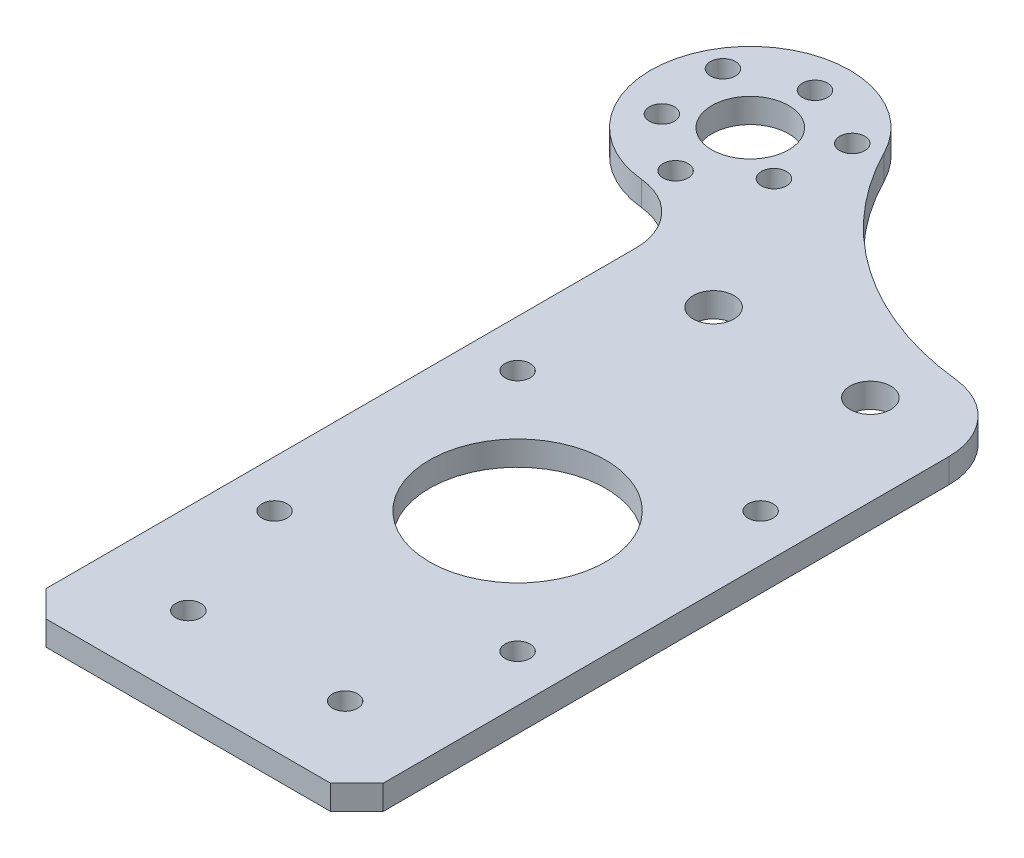
ISO-10303-21;
HEADER;
FILE_DESCRIPTION(('STEP AP214'),'2;1');
FILE_NAME('part.step','',(''),(''),'','','');
FILE_SCHEMA(('AUTOMOTIVE_DESIGN { 1 0 10303 214 1 1 1 1 }'));
ENDSEC;
DATA;
#1=APPLICATION_CONTEXT('core data for automotive mechanical design processes');
#2=APPLICATION_PROTOCOL_DEFINITION('international standard','automotive_design',2000,#1);
#3=PRODUCT_CONTEXT('',#1,'mechanical');
#4=PRODUCT('Part','Part','',(#3));
#5=PRODUCT_RELATED_PRODUCT_CATEGORY('part','',(#4));
#6=PRODUCT_DEFINITION_FORMATION('','',#4);
#7=PRODUCT_DEFINITION_CONTEXT('part definition',#1,'design');
#8=PRODUCT_DEFINITION('design','',#6,#7);
#9=PRODUCT_DEFINITION_SHAPE('','',#8);
#10=(LENGTH_UNIT() NAMED_UNIT(*) SI_UNIT(.MILLI.,.METRE.));
#11=(NAMED_UNIT(*) PLANE_ANGLE_UNIT() SI_UNIT($,.RADIAN.));
#12=(NAMED_UNIT(*) SI_UNIT($,.STERADIAN.) SOLID_ANGLE_UNIT());
#13=UNCERTAINTY_MEASURE_WITH_UNIT(LENGTH_MEASURE(1.E-05),#10,'distance_accuracy_value','');
#14=(GEOMETRIC_REPRESENTATION_CONTEXT(3) GLOBAL_UNCERTAINTY_ASSIGNED_CONTEXT((#13)) GLOBAL_UNIT_ASSIGNED_CONTEXT((#10,
#11,#12)) REPRESENTATION_CONTEXT('',''));
#15=CARTESIAN_POINT('',(0.,0.,0.));
#16=DIRECTION('',(0.,0.,1.));
#17=DIRECTION('',(1.,0.,0.));
#18=AXIS2_PLACEMENT_3D('',#15,#16,#17);
#19=CARTESIAN_POINT('',(-27.5,3.125,-99.18));
#20=DIRECTION('',(0.,1.,0.));
#21=DIRECTION('',(0.,0.,1.));
#22=AXIS2_PLACEMENT_3D('',#19,#20,#21);
#23=PLANE('',#22);
#24=CARTESIAN_POINT('',(-19.25,3.125,-103.943139720814));
#25=DIRECTION('',(0.,1.,0.));
#26=DIRECTION('',(0.,0.,1.));
#27=AXIS2_PLACEMENT_3D('',#24,#25,#26);
#28=CIRCLE('',#27,1.60000000000001);
#29=CARTESIAN_POINT('',(-19.25,3.125,-102.343139720814));
#30=VERTEX_POINT('',#29);
#31=EDGE_CURVE('E293',#30,#30,#28,.T.);
#32=ORIENTED_EDGE('',*,*,#31,.F.);
#33=EDGE_LOOP('',(#32));
#34=FACE_BOUND('',#33,.T.);
#35=CARTESIAN_POINT('',(-35.75,3.125,-103.943139720814));
#36=DIRECTION('',(0.,1.,0.));
#37=DIRECTION('',(0.,0.,1.));
#38=AXIS2_PLACEMENT_3D('',#35,#36,#37);
#39=CIRCLE('',#38,1.60000000000001);
#40=CARTESIAN_POINT('',(-35.75,3.125,-102.343139720814));
#41=VERTEX_POINT('',#40);
#42=EDGE_CURVE('E287',#41,#41,#39,.T.);
#43=ORIENTED_EDGE('',*,*,#42,.F.);
#44=EDGE_LOOP('',(#43));
#45=FACE_BOUND('',#44,.T.);
#46=CARTESIAN_POINT('',(-27.5,3.125,-89.6537205583712));
#47=DIRECTION('',(0.,1.,0.));
#48=DIRECTION('',(0.,0.,1.));
#49=AXIS2_PLACEMENT_3D('',#46,#47,#48);
#50=CIRCLE('',#49,1.60000000000001);
#51=CARTESIAN_POINT('',(-27.5,3.125,-88.0537205583712));
#52=VERTEX_POINT('',#51);
#53=EDGE_CURVE('E281',#52,#52,#50,.T.);
#54=ORIENTED_EDGE('',*,*,#53,.F.);
#55=EDGE_LOOP('',(#54));
#56=FACE_BOUND('',#55,.T.);
#57=CARTESIAN_POINT('',(-10.,3.125,-10.));
#58=DIRECTION('',(0.,1.,0.));
#59=DIRECTION('',(0.,0.,1.));
#60=AXIS2_PLACEMENT_3D('',#57,#58,#59);
#61=CIRCLE('',#60,1.6);
#62=CARTESIAN_POINT('',(-10.,3.125,-8.4));
#63=VERTEX_POINT('',#62);
#64=EDGE_CURVE('E264',#63,#63,#61,.T.);
#65=ORIENTED_EDGE('',*,*,#64,.F.);
#66=EDGE_LOOP('',(#65));
#67=FACE_BOUND('',#66,.T.);
#68=CARTESIAN_POINT('',(-9.99999999999997,3.125,-77.));
#69=DIRECTION('',(0.,1.,0.));
#70=DIRECTION('',(0.,0.,1.));
#71=AXIS2_PLACEMENT_3D('',#68,#69,#70);
#72=CIRCLE('',#71,2.6);
#73=CARTESIAN_POINT('',(-9.99999999999997,3.125,-74.4));
#74=VERTEX_POINT('',#73);
#75=EDGE_CURVE('E252',#74,#74,#72,.T.);
#76=ORIENTED_EDGE('',*,*,#75,.F.);
#77=EDGE_LOOP('',(#76));
#78=FACE_BOUND('',#77,.T.);
#79=CARTESIAN_POINT('',(-27.5,3.125,-107.43));
#80=DIRECTION('',(0.,1.,0.));
#81=DIRECTION('',(0.,0.,1.));
#82=AXIS2_PLACEMENT_3D('',#79,#80,#81);
#83=CIRCLE('',#82,1.59999999999996);
#84=CARTESIAN_POINT('',(-27.5,3.125,-105.83));
#85=VERTEX_POINT('',#84);
#86=EDGE_CURVE('E240',#85,#85,#83,.T.);
#87=ORIENTED_EDGE('',*,*,#86,.F.);
#88=EDGE_LOOP('',(#87));
#89=FACE_BOUND('',#88,.T.);
#90=CARTESIAN_POINT('',(15.5,3.125,-26.5));
#91=DIRECTION('',(0.,1.,0.));
#92=DIRECTION('',(0.,0.,1.));
#93=AXIS2_PLACEMENT_3D('',#90,#91,#92);
#94=CIRCLE('',#93,1.6);
#95=CARTESIAN_POINT('',(15.5,3.125,-24.9));
#96=VERTEX_POINT('',#95);
#97=EDGE_CURVE('E228',#96,#96,#94,.T.);
#98=ORIENTED_EDGE('',*,*,#97,.F.);
#99=EDGE_LOOP('',(#98));
#100=FACE_BOUND('',#99,.T.);
#101=CARTESIAN_POINT('',(-15.5,3.125,-57.5));
#102=DIRECTION('',(0.,1.,0.));
#103=DIRECTION('',(0.,0.,1.));
#104=AXIS2_PLACEMENT_3D('',#101,#102,#103);
#105=CIRCLE('',#104,1.6);
#106=CARTESIAN_POINT('',(-15.5,3.125,-55.9));
#107=VERTEX_POINT('',#106);
#108=EDGE_CURVE('E216',#107,#107,#105,.T.);
#109=ORIENTED_EDGE('',*,*,#108,.F.);
#110=EDGE_LOOP('',(#109));
#111=FACE_BOUND('',#110,.T.);
#112=CARTESIAN_POINT('',(-27.5,3.125,-99.18));
#113=DIRECTION('',(0.,1.,0.));
#114=DIRECTION('',(0.,0.,1.));
#115=AXIS2_PLACEMENT_3D('',#112,#113,#114);
#116=CIRCLE('',#115,4.90000000000001);
#117=CARTESIAN_POINT('',(-27.5,3.125,-94.28));
#118=VERTEX_POINT('',#117);
#119=EDGE_CURVE('E204',#118,#118,#116,.T.);
#120=ORIENTED_EDGE('',*,*,#119,.F.);
#121=EDGE_LOOP('',(#120));
#122=FACE_BOUND('',#121,.T.);
#123=CARTESIAN_POINT('',(-27.5,3.125,-99.18));
#124=DIRECTION('',(0.,1.,0.));
#125=DIRECTION('',(0.,0.,1.));
#126=AXIS2_PLACEMENT_3D('',#123,#124,#125);
#127=CIRCLE('',#126,12.7);
#128=CARTESIAN_POINT('',(-16.1734906297064,3.125,-104.924578790882));
#129=VERTEX_POINT('',#128);
#130=CARTESIAN_POINT('',(-28.7270531400966,3.125,-86.5394169204352));
#131=VERTEX_POINT('',#130);
#132=EDGE_CURVE('E112',#129,#131,#127,.T.);
#133=ORIENTED_EDGE('',*,*,#132,.T.);
#134=CARTESIAN_POINT('',(-29.4999999999999,3.125,-78.5768449018118));
#135=DIRECTION('',(0.,1.,0.));
#136=DIRECTION('',(0.,0.,1.));
#137=AXIS2_PLACEMENT_3D('',#134,#135,#136);
#138=CIRCLE('',#137,8.);
#139=CARTESIAN_POINT('',(-21.4999999999999,3.125,-78.5768449018118));
#140=VERTEX_POINT('',#139);
#141=EDGE_CURVE('E11',#131,#140,#138,.F.);
#142=ORIENTED_EDGE('',*,*,#141,.T.);
#143=DIRECTION('',(0.,0.,1.));
#144=VECTOR('',#143,1.);
#145=CARTESIAN_POINT('',(-21.4999999999999,3.125,-86.48));
#146=LINE('',#145,#144);
#147=CARTESIAN_POINT('',(-21.4999999999999,3.125,-3.35));
#148=VERTEX_POINT('',#147);
#149=EDGE_CURVE('E102',#140,#148,#146,.T.);
#150=ORIENTED_EDGE('',*,*,#149,.T.);
#151=DIRECTION('',(0.707106781186547,0.,0.707106781186548));
#152=VECTOR('',#151,1.);
#153=CARTESIAN_POINT('',(-21.4999999999999,3.125,-3.35));
#154=LINE('',#153,#152);
#155=CARTESIAN_POINT('',(-18.1499999999999,3.125,0.));
#156=VERTEX_POINT('',#155);
#157=EDGE_CURVE('E106',#148,#156,#154,.T.);
#158=ORIENTED_EDGE('',*,*,#157,.T.);
#159=DIRECTION('',(1.,0.,0.));
#160=VECTOR('',#159,1.);
#161=CARTESIAN_POINT('',(-18.1499999999999,3.125,0.));
#162=LINE('',#161,#160);
#163=CARTESIAN_POINT('',(18.1499999999999,3.125,0.));
#164=VERTEX_POINT('',#163);
#165=EDGE_CURVE('E126',#156,#164,#162,.T.);
#166=ORIENTED_EDGE('',*,*,#165,.T.);
#167=DIRECTION('',(0.707106781186547,0.,-0.707106781186548));
#168=VECTOR('',#167,1.);
#169=CARTESIAN_POINT('',(18.1499999999999,3.125,0.));
#170=LINE('',#169,#168);
#171=CARTESIAN_POINT('',(21.4999999999999,3.125,-3.35));
#172=VERTEX_POINT('',#171);
#173=EDGE_CURVE('E128',#164,#172,#170,.T.);
#174=ORIENTED_EDGE('',*,*,#173,.T.);
#175=DIRECTION('',(0.,0.,-1.));
#176=VECTOR('',#175,1.);
#177=CARTESIAN_POINT('',(21.4999999999999,3.125,-75.5174918188422));
#178=LINE('',#177,#176);
#179=CARTESIAN_POINT('',(21.4999999999999,3.125,-75.5174918188422));
#180=VERTEX_POINT('',#179);
#181=EDGE_CURVE('E133',#172,#180,#178,.T.);
#182=ORIENTED_EDGE('',*,*,#181,.T.);
#183=CARTESIAN_POINT('',(12.4999999999999,3.125,-75.5174918188422));
#184=DIRECTION('',(0.,1.,0.));
#185=DIRECTION('',(0.,0.,-1.));
#186=AXIS2_PLACEMENT_3D('',#183,#184,#185);
#187=CIRCLE('',#186,9.);
#188=CARTESIAN_POINT('',(13.4613905083696,3.125,-84.4659960676212));
#189=VERTEX_POINT('',#188);
#190=EDGE_CURVE('E135',#180,#189,#187,.T.);
#191=ORIENTED_EDGE('',*,*,#190,.T.);
#192=CARTESIAN_POINT('',(17.4938895851426,3.125,-122.));
#193=DIRECTION('',(0.,-1.,0.));
#194=DIRECTION('',(0.,0.,1.));
#195=AXIS2_PLACEMENT_3D('',#192,#193,#194);
#196=CIRCLE('',#195,37.75);
#197=EDGE_CURVE('E137',#189,#129,#196,.T.);
#198=ORIENTED_EDGE('',*,*,#197,.T.);
#199=EDGE_LOOP('',(#133,#142,#150,#158,#166,#174,#182,#191,#198));
#200=FACE_BOUND('',#199,.T.);
#201=CARTESIAN_POINT('',(0.,3.125,-42.));
#202=DIRECTION('',(0.,1.,0.));
#203=DIRECTION('',(0.,0.,1.));
#204=AXIS2_PLACEMENT_3D('',#201,#202,#203);
#205=CIRCLE('',#204,11.25);
#206=CARTESIAN_POINT('',(0.,3.125,-30.75));
#207=VERTEX_POINT('',#206);
#208=EDGE_CURVE('E142',#207,#207,#205,.T.);
#209=ORIENTED_EDGE('',*,*,#208,.F.);
#210=EDGE_LOOP('',(#209));
#211=FACE_BOUND('',#210,.T.);
#212=CARTESIAN_POINT('',(-15.5,3.125,-26.5));
#213=DIRECTION('',(0.,1.,0.));
#214=DIRECTION('',(0.,0.,1.));
#215=AXIS2_PLACEMENT_3D('',#212,#213,#214);
#216=CIRCLE('',#215,1.6);
#217=CARTESIAN_POINT('',(-15.5,3.125,-24.9));
#218=VERTEX_POINT('',#217);
#219=EDGE_CURVE('E210',#218,#218,#216,.T.);
#220=ORIENTED_EDGE('',*,*,#219,.F.);
#221=EDGE_LOOP('',(#220));
#222=FACE_BOUND('',#221,.T.);
#223=CARTESIAN_POINT('',(15.5,3.125,-57.5));
#224=DIRECTION('',(0.,1.,0.));
#225=DIRECTION('',(0.,0.,1.));
#226=AXIS2_PLACEMENT_3D('',#223,#224,#225);
#227=CIRCLE('',#226,1.60000000000001);
#228=CARTESIAN_POINT('',(15.5,3.125,-55.9));
#229=VERTEX_POINT('',#228);
#230=EDGE_CURVE('E222',#229,#229,#227,.T.);
#231=ORIENTED_EDGE('',*,*,#230,.F.);
#232=EDGE_LOOP('',(#231));
#233=FACE_BOUND('',#232,.T.);
#234=CARTESIAN_POINT('',(-34.6447095812216,3.125,-95.055));
#235=DIRECTION('',(0.,1.,0.));
#236=DIRECTION('',(0.,0.,1.));
#237=AXIS2_PLACEMENT_3D('',#234,#235,#236);
#238=CIRCLE('',#237,1.6);
#239=CARTESIAN_POINT('',(-34.6447095812216,3.125,-93.455));
#240=VERTEX_POINT('',#239);
#241=EDGE_CURVE('E234',#240,#240,#238,.T.);
#242=ORIENTED_EDGE('',*,*,#241,.F.);
#243=EDGE_LOOP('',(#242));
#244=FACE_BOUND('',#243,.T.);
#245=CARTESIAN_POINT('',(9.99999999999997,3.125,-77.));
#246=DIRECTION('',(0.,1.,0.));
#247=DIRECTION('',(0.,0.,1.));
#248=AXIS2_PLACEMENT_3D('',#245,#246,#247);
#249=CIRCLE('',#248,2.6);
#250=CARTESIAN_POINT('',(9.99999999999997,3.125,-74.4));
#251=VERTEX_POINT('',#250);
#252=EDGE_CURVE('E246',#251,#251,#249,.T.);
#253=ORIENTED_EDGE('',*,*,#252,.F.);
#254=EDGE_LOOP('',(#253));
#255=FACE_BOUND('',#254,.T.);
#256=CARTESIAN_POINT('',(10.,3.125,-10.));
#257=DIRECTION('',(0.,1.,0.));
#258=DIRECTION('',(0.,0.,1.));
#259=AXIS2_PLACEMENT_3D('',#256,#257,#258);
#260=CIRCLE('',#259,1.6);
#261=CARTESIAN_POINT('',(10.,3.125,-8.4));
#262=VERTEX_POINT('',#261);
#263=EDGE_CURVE('E258',#262,#262,#260,.T.);
#264=ORIENTED_EDGE('',*,*,#263,.F.);
#265=EDGE_LOOP('',(#264));
#266=FACE_BOUND('',#265,.T.);
#267=CARTESIAN_POINT('',(-20.3552904187783,3.125,-95.055));
#268=DIRECTION('',(0.,1.,0.));
#269=DIRECTION('',(0.,0.,1.));
#270=AXIS2_PLACEMENT_3D('',#267,#268,#269);
#271=CIRCLE('',#270,1.60000000000002);
#272=CARTESIAN_POINT('',(-20.3552904187783,3.125,-93.455));
#273=VERTEX_POINT('',#272);
#274=EDGE_CURVE('E270',#273,#273,#271,.T.);
#275=ORIENTED_EDGE('',*,*,#274,.F.);
#276=EDGE_LOOP('',(#275));
#277=FACE_BOUND('',#276,.T.);
#278=ADVANCED_FACE('F32',(#34,#45,#56,#67,#78,#89,#100,#111,#122,#200,#211,#222,#233,#244,#255,
#266,#277),#23,.T.);
#279=CARTESIAN_POINT('',(-27.5,0.,-99.18));
#280=DIRECTION('',(0.,1.,0.));
#281=DIRECTION('',(0.,0.,1.));
#282=AXIS2_PLACEMENT_3D('',#279,#280,#281);
#283=PLANE('',#282);
#284=CARTESIAN_POINT('',(-19.25,0.,-103.943139720814));
#285=DIRECTION('',(0.,1.,0.));
#286=DIRECTION('',(0.,0.,1.));
#287=AXIS2_PLACEMENT_3D('',#284,#285,#286);
#288=CIRCLE('',#287,1.60000000000001);
#289=CARTESIAN_POINT('',(-19.25,0.,-102.343139720814));
#290=VERTEX_POINT('',#289);
#291=EDGE_CURVE('E290',#290,#290,#288,.F.);
#292=ORIENTED_EDGE('',*,*,#291,.F.);
#293=EDGE_LOOP('',(#292));
#294=FACE_BOUND('',#293,.T.);
#295=CARTESIAN_POINT('',(-35.75,0.,-103.943139720814));
#296=DIRECTION('',(0.,1.,0.));
#297=DIRECTION('',(0.,0.,1.));
#298=AXIS2_PLACEMENT_3D('',#295,#296,#297);
#299=CIRCLE('',#298,1.60000000000001);
#300=CARTESIAN_POINT('',(-35.75,0.,-102.343139720814));
#301=VERTEX_POINT('',#300);
#302=EDGE_CURVE('E284',#301,#301,#299,.F.);
#303=ORIENTED_EDGE('',*,*,#302,.F.);
#304=EDGE_LOOP('',(#303));
#305=FACE_BOUND('',#304,.T.);
#306=CARTESIAN_POINT('',(-27.5,0.,-89.6537205583712));
#307=DIRECTION('',(0.,1.,0.));
#308=DIRECTION('',(0.,0.,1.));
#309=AXIS2_PLACEMENT_3D('',#306,#307,#308);
#310=CIRCLE('',#309,1.60000000000001);
#311=CARTESIAN_POINT('',(-27.5,0.,-88.0537205583712));
#312=VERTEX_POINT('',#311);
#313=EDGE_CURVE('E276',#312,#312,#310,.F.);
#314=ORIENTED_EDGE('',*,*,#313,.F.);
#315=EDGE_LOOP('',(#314));
#316=FACE_BOUND('',#315,.T.);
#317=CARTESIAN_POINT('',(-10.,0.,-10.));
#318=DIRECTION('',(0.,1.,0.));
#319=DIRECTION('',(0.,0.,1.));
#320=AXIS2_PLACEMENT_3D('',#317,#318,#319);
#321=CIRCLE('',#320,1.6);
#322=CARTESIAN_POINT('',(-10.,0.,-8.4));
#323=VERTEX_POINT('',#322);
#324=EDGE_CURVE('E267',#323,#323,#321,.T.);
#325=ORIENTED_EDGE('',*,*,#324,.T.);
#326=EDGE_LOOP('',(#325));
#327=FACE_BOUND('',#326,.T.);
#328=CARTESIAN_POINT('',(-9.99999999999997,0.,-77.));
#329=DIRECTION('',(0.,1.,0.));
#330=DIRECTION('',(0.,0.,1.));
#331=AXIS2_PLACEMENT_3D('',#328,#329,#330);
#332=CIRCLE('',#331,2.6);
#333=CARTESIAN_POINT('',(-9.99999999999997,0.,-74.4));
#334=VERTEX_POINT('',#333);
#335=EDGE_CURVE('E255',#334,#334,#332,.T.);
#336=ORIENTED_EDGE('',*,*,#335,.T.);
#337=EDGE_LOOP('',(#336));
#338=FACE_BOUND('',#337,.T.);
#339=CARTESIAN_POINT('',(-27.5,0.,-107.43));
#340=DIRECTION('',(0.,1.,0.));
#341=DIRECTION('',(0.,0.,1.));
#342=AXIS2_PLACEMENT_3D('',#339,#340,#341);
#343=CIRCLE('',#342,1.59999999999996);
#344=CARTESIAN_POINT('',(-27.5,0.,-105.83));
#345=VERTEX_POINT('',#344);
#346=EDGE_CURVE('E243',#345,#345,#343,.T.);
#347=ORIENTED_EDGE('',*,*,#346,.T.);
#348=EDGE_LOOP('',(#347));
#349=FACE_BOUND('',#348,.T.);
#350=CARTESIAN_POINT('',(15.5,0.,-26.5));
#351=DIRECTION('',(0.,1.,0.));
#352=DIRECTION('',(0.,0.,1.));
#353=AXIS2_PLACEMENT_3D('',#350,#351,#352);
#354=CIRCLE('',#353,1.6);
#355=CARTESIAN_POINT('',(15.5,0.,-24.9));
#356=VERTEX_POINT('',#355);
#357=EDGE_CURVE('E231',#356,#356,#354,.T.);
#358=ORIENTED_EDGE('',*,*,#357,.T.);
#359=EDGE_LOOP('',(#358));
#360=FACE_BOUND('',#359,.T.);
#361=CARTESIAN_POINT('',(-15.5,0.,-57.5));
#362=DIRECTION('',(0.,1.,0.));
#363=DIRECTION('',(0.,0.,1.));
#364=AXIS2_PLACEMENT_3D('',#361,#362,#363);
#365=CIRCLE('',#364,1.6);
#366=CARTESIAN_POINT('',(-15.5,0.,-55.9));
#367=VERTEX_POINT('',#366);
#368=EDGE_CURVE('E219',#367,#367,#365,.T.);
#369=ORIENTED_EDGE('',*,*,#368,.T.);
#370=EDGE_LOOP('',(#369));
#371=FACE_BOUND('',#370,.T.);
#372=CARTESIAN_POINT('',(-27.5,0.,-99.18));
#373=DIRECTION('',(0.,1.,0.));
#374=DIRECTION('',(0.,0.,1.));
#375=AXIS2_PLACEMENT_3D('',#372,#373,#374);
#376=CIRCLE('',#375,4.90000000000001);
#377=CARTESIAN_POINT('',(-27.5,0.,-94.28));
#378=VERTEX_POINT('',#377);
#379=EDGE_CURVE('E207',#378,#378,#376,.T.);
#380=ORIENTED_EDGE('',*,*,#379,.T.);
#381=EDGE_LOOP('',(#380));
#382=FACE_BOUND('',#381,.T.);
#383=CARTESIAN_POINT('',(-27.5,0.,-99.18));
#384=DIRECTION('',(0.,1.,0.));
#385=DIRECTION('',(0.,0.,1.));
#386=AXIS2_PLACEMENT_3D('',#383,#384,#385);
#387=CIRCLE('',#386,12.7);
#388=CARTESIAN_POINT('',(-16.1734906297064,0.,-104.924578790882));
#389=VERTEX_POINT('',#388);
#390=CARTESIAN_POINT('',(-28.7270531400966,0.,-86.5394169204352));
#391=VERTEX_POINT('',#390);
#392=EDGE_CURVE('E140',#389,#391,#387,.T.);
#393=ORIENTED_EDGE('',*,*,#392,.F.);
#394=CARTESIAN_POINT('',(17.4938895851426,0.,-122.));
#395=DIRECTION('',(0.,-1.,0.));
#396=DIRECTION('',(0.,0.,1.));
#397=AXIS2_PLACEMENT_3D('',#394,#395,#396);
#398=CIRCLE('',#397,37.75);
#399=CARTESIAN_POINT('',(13.4613905083696,0.,-84.4659960676212));
#400=VERTEX_POINT('',#399);
#401=EDGE_CURVE('E154',#400,#389,#398,.T.);
#402=ORIENTED_EDGE('',*,*,#401,.F.);
#403=CARTESIAN_POINT('',(12.4999999999999,0.,-75.5174918188422));
#404=DIRECTION('',(0.,1.,0.));
#405=DIRECTION('',(0.,0.,-1.));
#406=AXIS2_PLACEMENT_3D('',#403,#404,#405);
#407=CIRCLE('',#406,9.);
#408=CARTESIAN_POINT('',(21.4999999999999,0.,-75.5174918188422));
#409=VERTEX_POINT('',#408);
#410=EDGE_CURVE('E152',#409,#400,#407,.T.);
#411=ORIENTED_EDGE('',*,*,#410,.F.);
#412=DIRECTION('',(0.,0.,-1.));
#413=VECTOR('',#412,1.);
#414=CARTESIAN_POINT('',(21.4999999999999,0.,-75.5174918188422));
#415=LINE('',#414,#413);
#416=CARTESIAN_POINT('',(21.4999999999999,0.,-3.35));
#417=VERTEX_POINT('',#416);
#418=EDGE_CURVE('E150',#417,#409,#415,.T.);
#419=ORIENTED_EDGE('',*,*,#418,.F.);
#420=DIRECTION('',(0.707106781186547,0.,-0.707106781186548));
#421=VECTOR('',#420,1.);
#422=CARTESIAN_POINT('',(18.1499999999999,0.,0.));
#423=LINE('',#422,#421);
#424=CARTESIAN_POINT('',(18.1499999999999,0.,0.));
#425=VERTEX_POINT('',#424);
#426=EDGE_CURVE('E148',#425,#417,#423,.T.);
#427=ORIENTED_EDGE('',*,*,#426,.F.);
#428=DIRECTION('',(1.,0.,0.));
#429=VECTOR('',#428,1.);
#430=CARTESIAN_POINT('',(-18.1499999999999,0.,0.));
#431=LINE('',#430,#429);
#432=CARTESIAN_POINT('',(-18.1499999999999,0.,0.));
#433=VERTEX_POINT('',#432);
#434=EDGE_CURVE('E146',#433,#425,#431,.T.);
#435=ORIENTED_EDGE('',*,*,#434,.F.);
#436=DIRECTION('',(0.707106781186547,0.,0.707106781186548));
#437=VECTOR('',#436,1.);
#438=CARTESIAN_POINT('',(-21.4999999999999,0.,-3.35));
#439=LINE('',#438,#437);
#440=CARTESIAN_POINT('',(-21.4999999999999,0.,-3.35));
#441=VERTEX_POINT('',#440);
#442=EDGE_CURVE('E144',#441,#433,#439,.T.);
#443=ORIENTED_EDGE('',*,*,#442,.F.);
#444=DIRECTION('',(0.,0.,1.));
#445=VECTOR('',#444,1.);
#446=CARTESIAN_POINT('',(-21.4999999999999,0.,-86.48));
#447=LINE('',#446,#445);
#448=CARTESIAN_POINT('',(-21.4999999999999,0.,-78.5768449018118));
#449=VERTEX_POINT('',#448);
#450=EDGE_CURVE('E117',#449,#441,#447,.T.);
#451=ORIENTED_EDGE('',*,*,#450,.F.);
#452=CARTESIAN_POINT('',(-29.4999999999999,0.,-78.5768449018118));
#453=DIRECTION('',(0.,1.,0.));
#454=DIRECTION('',(0.,0.,1.));
#455=AXIS2_PLACEMENT_3D('',#452,#453,#454);
#456=CIRCLE('',#455,8.);
#457=EDGE_CURVE('E40',#449,#391,#456,.T.);
#458=ORIENTED_EDGE('',*,*,#457,.T.);
#459=EDGE_LOOP('',(#393,#402,#411,#419,#427,#435,#443,#451,#458));
#460=FACE_BOUND('',#459,.T.);
#461=CARTESIAN_POINT('',(0.,0.,-42.));
#462=DIRECTION('',(0.,1.,0.));
#463=DIRECTION('',(0.,0.,1.));
#464=AXIS2_PLACEMENT_3D('',#461,#462,#463);
#465=CIRCLE('',#464,11.25);
#466=CARTESIAN_POINT('',(0.,0.,-30.75));
#467=VERTEX_POINT('',#466);
#468=EDGE_CURVE('E201',#467,#467,#465,.T.);
#469=ORIENTED_EDGE('',*,*,#468,.T.);
#470=EDGE_LOOP('',(#469));
#471=FACE_BOUND('',#470,.T.);
#472=CARTESIAN_POINT('',(-15.5,0.,-26.5));
#473=DIRECTION('',(0.,1.,0.));
#474=DIRECTION('',(0.,0.,1.));
#475=AXIS2_PLACEMENT_3D('',#472,#473,#474);
#476=CIRCLE('',#475,1.6);
#477=CARTESIAN_POINT('',(-15.5,0.,-24.9));
#478=VERTEX_POINT('',#477);
#479=EDGE_CURVE('E213',#478,#478,#476,.T.);
#480=ORIENTED_EDGE('',*,*,#479,.T.);
#481=EDGE_LOOP('',(#480));
#482=FACE_BOUND('',#481,.T.);
#483=CARTESIAN_POINT('',(15.5,0.,-57.5));
#484=DIRECTION('',(0.,1.,0.));
#485=DIRECTION('',(0.,0.,1.));
#486=AXIS2_PLACEMENT_3D('',#483,#484,#485);
#487=CIRCLE('',#486,1.60000000000001);
#488=CARTESIAN_POINT('',(15.5,0.,-55.9));
#489=VERTEX_POINT('',#488);
#490=EDGE_CURVE('E225',#489,#489,#487,.T.);
#491=ORIENTED_EDGE('',*,*,#490,.T.);
#492=EDGE_LOOP('',(#491));
#493=FACE_BOUND('',#492,.T.);
#494=CARTESIAN_POINT('',(-34.6447095812216,0.,-95.055));
#495=DIRECTION('',(0.,1.,0.));
#496=DIRECTION('',(0.,0.,1.));
#497=AXIS2_PLACEMENT_3D('',#494,#495,#496);
#498=CIRCLE('',#497,1.6);
#499=CARTESIAN_POINT('',(-34.6447095812216,0.,-93.455));
#500=VERTEX_POINT('',#499);
#501=EDGE_CURVE('E237',#500,#500,#498,.T.);
#502=ORIENTED_EDGE('',*,*,#501,.T.);
#503=EDGE_LOOP('',(#502));
#504=FACE_BOUND('',#503,.T.);
#505=CARTESIAN_POINT('',(9.99999999999997,0.,-77.));
#506=DIRECTION('',(0.,1.,0.));
#507=DIRECTION('',(0.,0.,1.));
#508=AXIS2_PLACEMENT_3D('',#505,#506,#507);
#509=CIRCLE('',#508,2.6);
#510=CARTESIAN_POINT('',(9.99999999999997,0.,-74.4));
#511=VERTEX_POINT('',#510);
#512=EDGE_CURVE('E249',#511,#511,#509,.T.);
#513=ORIENTED_EDGE('',*,*,#512,.T.);
#514=EDGE_LOOP('',(#513));
#515=FACE_BOUND('',#514,.T.);
#516=CARTESIAN_POINT('',(10.,0.,-10.));
#517=DIRECTION('',(0.,1.,0.));
#518=DIRECTION('',(0.,0.,1.));
#519=AXIS2_PLACEMENT_3D('',#516,#517,#518);
#520=CIRCLE('',#519,1.6);
#521=CARTESIAN_POINT('',(10.,0.,-8.4));
#522=VERTEX_POINT('',#521);
#523=EDGE_CURVE('E261',#522,#522,#520,.T.);
#524=ORIENTED_EDGE('',*,*,#523,.T.);
#525=EDGE_LOOP('',(#524));
#526=FACE_BOUND('',#525,.T.);
#527=CARTESIAN_POINT('',(-20.3552904187783,0.,-95.055));
#528=DIRECTION('',(0.,1.,0.));
#529=DIRECTION('',(0.,0.,1.));
#530=AXIS2_PLACEMENT_3D('',#527,#528,#529);
#531=CIRCLE('',#530,1.60000000000002);
#532=CARTESIAN_POINT('',(-20.3552904187783,0.,-93.455));
#533=VERTEX_POINT('',#532);
#534=EDGE_CURVE('E273',#533,#533,#531,.T.);
#535=ORIENTED_EDGE('',*,*,#534,.T.);
#536=EDGE_LOOP('',(#535));
#537=FACE_BOUND('',#536,.T.);
#538=ADVANCED_FACE('F173',(#294,#305,#316,#327,#338,#349,#360,#371,#382,#460,#471,#482,#493,
#504,#515,#526,#537),#283,.F.);
#539=CARTESIAN_POINT('',(-27.5,3.125,-99.18));
#540=DIRECTION('',(0.,-1.,0.));
#541=DIRECTION('',(0.,0.,-1.));
#542=AXIS2_PLACEMENT_3D('',#539,#540,#541);
#543=CYLINDRICAL_SURFACE('',#542,12.7);
#544=ORIENTED_EDGE('',*,*,#392,.T.);
#545=DIRECTION('',(0.,-1.,0.));
#546=VECTOR('',#545,1.);
#547=CARTESIAN_POINT('',(-28.7270531400966,3.125,-86.5394169204352));
#548=LINE('',#547,#546);
#549=EDGE_CURVE('E47',#391,#131,#548,.F.);
#550=ORIENTED_EDGE('',*,*,#549,.T.);
#551=ORIENTED_EDGE('',*,*,#132,.F.);
#552=DIRECTION('',(0.,-1.,0.));
#553=VECTOR('',#552,1.);
#554=CARTESIAN_POINT('',(-16.1734906297064,3.125,-104.924578790882));
#555=LINE('',#554,#553);
#556=EDGE_CURVE('E139',#129,#389,#555,.T.);
#557=ORIENTED_EDGE('',*,*,#556,.T.);
#558=EDGE_LOOP('',(#544,#550,#551,#557));
#559=FACE_BOUND('',#558,.T.);
#560=ADVANCED_FACE('F199',(#559),#543,.T.);
#561=CARTESIAN_POINT('',(-21.4999999999999,3.125,-86.48));
#562=DIRECTION('',(1.,0.,0.));
#563=DIRECTION('',(0.,0.,-1.));
#564=AXIS2_PLACEMENT_3D('',#561,#562,#563);
#565=PLANE('',#564);
#566=ORIENTED_EDGE('',*,*,#149,.F.);
#567=DIRECTION('',(0.,1.,0.));
#568=VECTOR('',#567,1.);
#569=CARTESIAN_POINT('',(-21.4999999999999,0.,-78.5768449018118));
#570=LINE('',#569,#568);
#571=EDGE_CURVE('E120',#140,#449,#570,.F.);
#572=ORIENTED_EDGE('',*,*,#571,.T.);
#573=ORIENTED_EDGE('',*,*,#450,.T.);
#574=DIRECTION('',(0.,-1.,0.));
#575=VECTOR('',#574,1.);
#576=CARTESIAN_POINT('',(-21.4999999999999,3.125,-3.35));
#577=LINE('',#576,#575);
#578=EDGE_CURVE('E115',#148,#441,#577,.T.);
#579=ORIENTED_EDGE('',*,*,#578,.F.);
#580=EDGE_LOOP('',(#566,#572,#573,#579));
#581=FACE_BOUND('',#580,.T.);
#582=ADVANCED_FACE('F116',(#581),#565,.F.);
#583=CARTESIAN_POINT('',(-21.4999999999999,3.125,-3.35));
#584=DIRECTION('',(0.707106781186548,0.,-0.707106781186547));
#585=DIRECTION('',(-0.707106781186547,0.,-0.707106781186548));
#586=AXIS2_PLACEMENT_3D('',#583,#584,#585);
#587=PLANE('',#586);
#588=ORIENTED_EDGE('',*,*,#442,.T.);
#589=DIRECTION('',(0.,-1.,0.));
#590=VECTOR('',#589,1.);
#591=CARTESIAN_POINT('',(-18.1499999999999,3.125,0.));
#592=LINE('',#591,#590);
#593=EDGE_CURVE('E121',#156,#433,#592,.T.);
#594=ORIENTED_EDGE('',*,*,#593,.F.);
#595=ORIENTED_EDGE('',*,*,#157,.F.);
#596=ORIENTED_EDGE('',*,*,#578,.T.);
#597=EDGE_LOOP('',(#588,#594,#595,#596));
#598=FACE_BOUND('',#597,.T.);
#599=ADVANCED_FACE('F123',(#598),#587,.F.);
#600=CARTESIAN_POINT('',(-18.1499999999999,3.125,0.));
#601=DIRECTION('',(0.,0.,-1.));
#602=DIRECTION('',(-1.,0.,0.));
#603=AXIS2_PLACEMENT_3D('',#600,#601,#602);
#604=PLANE('',#603);
#605=ORIENTED_EDGE('',*,*,#434,.T.);
#606=DIRECTION('',(0.,-1.,0.));
#607=VECTOR('',#606,1.);
#608=CARTESIAN_POINT('',(18.1499999999999,3.125,0.));
#609=LINE('',#608,#607);
#610=EDGE_CURVE('E167',#164,#425,#609,.T.);
#611=ORIENTED_EDGE('',*,*,#610,.F.);
#612=ORIENTED_EDGE('',*,*,#165,.F.);
#613=ORIENTED_EDGE('',*,*,#593,.T.);
#614=EDGE_LOOP('',(#605,#611,#612,#613));
#615=FACE_BOUND('',#614,.T.);
#616=ADVANCED_FACE('F178',(#615),#604,.F.);
#617=CARTESIAN_POINT('',(18.1499999999999,3.125,0.));
#618=DIRECTION('',(-0.707106781186548,0.,-0.707106781186547));
#619=DIRECTION('',(-0.707106781186547,0.,0.707106781186548));
#620=AXIS2_PLACEMENT_3D('',#617,#618,#619);
#621=PLANE('',#620);
#622=ORIENTED_EDGE('',*,*,#426,.T.);
#623=DIRECTION('',(0.,-1.,0.));
#624=VECTOR('',#623,1.);
#625=CARTESIAN_POINT('',(21.4999999999999,3.125,-3.35));
#626=LINE('',#625,#624);
#627=EDGE_CURVE('E164',#172,#417,#626,.T.);
#628=ORIENTED_EDGE('',*,*,#627,.F.);
#629=ORIENTED_EDGE('',*,*,#173,.F.);
#630=ORIENTED_EDGE('',*,*,#610,.T.);
#631=EDGE_LOOP('',(#622,#628,#629,#630));
#632=FACE_BOUND('',#631,.T.);
#633=ADVANCED_FACE('F185',(#632),#621,.F.);
#634=CARTESIAN_POINT('',(21.4999999999999,3.125,-75.5174918188422));
#635=DIRECTION('',(-1.,0.,0.));
#636=DIRECTION('',(0.,0.,1.));
#637=AXIS2_PLACEMENT_3D('',#634,#635,#636);
#638=PLANE('',#637);
#639=ORIENTED_EDGE('',*,*,#418,.T.);
#640=DIRECTION('',(0.,-1.,0.));
#641=VECTOR('',#640,1.);
#642=CARTESIAN_POINT('',(21.4999999999999,3.125,-75.5174918188422));
#643=LINE('',#642,#641);
#644=EDGE_CURVE('E161',#180,#409,#643,.T.);
#645=ORIENTED_EDGE('',*,*,#644,.F.);
#646=ORIENTED_EDGE('',*,*,#181,.F.);
#647=ORIENTED_EDGE('',*,*,#627,.T.);
#648=EDGE_LOOP('',(#639,#645,#646,#647));
#649=FACE_BOUND('',#648,.T.);
#650=ADVANCED_FACE('F188',(#649),#638,.F.);
#651=CARTESIAN_POINT('',(12.4999999999999,3.125,-75.5174918188422));
#652=DIRECTION('',(0.,-1.,0.));
#653=DIRECTION('',(0.,0.,-1.));
#654=AXIS2_PLACEMENT_3D('',#651,#652,#653);
#655=CYLINDRICAL_SURFACE('',#654,9.);
#656=ORIENTED_EDGE('',*,*,#410,.T.);
#657=DIRECTION('',(0.,-1.,0.));
#658=VECTOR('',#657,1.);
#659=CARTESIAN_POINT('',(13.4613905083696,3.125,-84.4659960676212));
#660=LINE('',#659,#658);
#661=EDGE_CURVE('E158',#189,#400,#660,.T.);
#662=ORIENTED_EDGE('',*,*,#661,.F.);
#663=ORIENTED_EDGE('',*,*,#190,.F.);
#664=ORIENTED_EDGE('',*,*,#644,.T.);
#665=EDGE_LOOP('',(#656,#662,#663,#664));
#666=FACE_BOUND('',#665,.T.);
#667=ADVANCED_FACE('F193',(#666),#655,.T.);
#668=CARTESIAN_POINT('',(17.4938895851426,3.125,-122.));
#669=DIRECTION('',(0.,-1.,0.));
#670=DIRECTION('',(0.,0.,-1.));
#671=AXIS2_PLACEMENT_3D('',#668,#669,#670);
#672=CYLINDRICAL_SURFACE('',#671,37.75);
#673=ORIENTED_EDGE('',*,*,#401,.T.);
#674=ORIENTED_EDGE('',*,*,#556,.F.);
#675=ORIENTED_EDGE('',*,*,#197,.F.);
#676=ORIENTED_EDGE('',*,*,#661,.T.);
#677=EDGE_LOOP('',(#673,#674,#675,#676));
#678=FACE_BOUND('',#677,.T.);
#679=ADVANCED_FACE('F197',(#678),#672,.F.);
#680=CARTESIAN_POINT('',(0.,3.125,-42.));
#681=DIRECTION('',(0.,-1.,0.));
#682=DIRECTION('',(0.,0.,-1.));
#683=AXIS2_PLACEMENT_3D('',#680,#681,#682);
#684=CYLINDRICAL_SURFACE('',#683,11.25);
#685=ORIENTED_EDGE('',*,*,#208,.T.);
#686=EDGE_LOOP('',(#685));
#687=FACE_BOUND('',#686,.T.);
#688=ORIENTED_EDGE('',*,*,#468,.F.);
#689=EDGE_LOOP('',(#688));
#690=FACE_BOUND('',#689,.T.);
#691=ADVANCED_FACE('F323',(#687,#690),#684,.F.);
#692=CARTESIAN_POINT('',(-27.5,3.125,-99.18));
#693=DIRECTION('',(0.,-1.,0.));
#694=DIRECTION('',(0.,0.,-1.));
#695=AXIS2_PLACEMENT_3D('',#692,#693,#694);
#696=CYLINDRICAL_SURFACE('',#695,4.90000000000001);
#697=ORIENTED_EDGE('',*,*,#119,.T.);
#698=EDGE_LOOP('',(#697));
#699=FACE_BOUND('',#698,.T.);
#700=ORIENTED_EDGE('',*,*,#379,.F.);
#701=EDGE_LOOP('',(#700));
#702=FACE_BOUND('',#701,.T.);
#703=ADVANCED_FACE('F319',(#699,#702),#696,.F.);
#704=CARTESIAN_POINT('',(-15.5,3.125,-26.5));
#705=DIRECTION('',(0.,-1.,0.));
#706=DIRECTION('',(0.,0.,-1.));
#707=AXIS2_PLACEMENT_3D('',#704,#705,#706);
#708=CYLINDRICAL_SURFACE('',#707,1.6);
#709=ORIENTED_EDGE('',*,*,#219,.T.);
#710=EDGE_LOOP('',(#709));
#711=FACE_BOUND('',#710,.T.);
#712=ORIENTED_EDGE('',*,*,#479,.F.);
#713=EDGE_LOOP('',(#712));
#714=FACE_BOUND('',#713,.T.);
#715=ADVANCED_FACE('F322',(#711,#714),#708,.F.);
#716=CARTESIAN_POINT('',(-15.5,3.125,-57.5));
#717=DIRECTION('',(0.,-1.,0.));
#718=DIRECTION('',(0.,0.,-1.));
#719=AXIS2_PLACEMENT_3D('',#716,#717,#718);
#720=CYLINDRICAL_SURFACE('',#719,1.6);
#721=ORIENTED_EDGE('',*,*,#108,.T.);
#722=EDGE_LOOP('',(#721));
#723=FACE_BOUND('',#722,.T.);
#724=ORIENTED_EDGE('',*,*,#368,.F.);
#725=EDGE_LOOP('',(#724));
#726=FACE_BOUND('',#725,.T.);
#727=ADVANCED_FACE('F395',(#723,#726),#720,.F.);
#728=CARTESIAN_POINT('',(15.5,3.125,-57.5));
#729=DIRECTION('',(0.,-1.,0.));
#730=DIRECTION('',(0.,0.,-1.));
#731=AXIS2_PLACEMENT_3D('',#728,#729,#730);
#732=CYLINDRICAL_SURFACE('',#731,1.60000000000001);
#733=ORIENTED_EDGE('',*,*,#230,.T.);
#734=EDGE_LOOP('',(#733));
#735=FACE_BOUND('',#734,.T.);
#736=ORIENTED_EDGE('',*,*,#490,.F.);
#737=EDGE_LOOP('',(#736));
#738=FACE_BOUND('',#737,.T.);
#739=ADVANCED_FACE('F403',(#735,#738),#732,.F.);
#740=CARTESIAN_POINT('',(15.5,3.125,-26.5));
#741=DIRECTION('',(0.,-1.,0.));
#742=DIRECTION('',(0.,0.,-1.));
#743=AXIS2_PLACEMENT_3D('',#740,#741,#742);
#744=CYLINDRICAL_SURFACE('',#743,1.6);
#745=ORIENTED_EDGE('',*,*,#97,.T.);
#746=EDGE_LOOP('',(#745));
#747=FACE_BOUND('',#746,.T.);
#748=ORIENTED_EDGE('',*,*,#357,.F.);
#749=EDGE_LOOP('',(#748));
#750=FACE_BOUND('',#749,.T.);
#751=ADVANCED_FACE('F411',(#747,#750),#744,.F.);
#752=CARTESIAN_POINT('',(-34.6447095812216,3.125,-95.055));
#753=DIRECTION('',(0.,-1.,0.));
#754=DIRECTION('',(0.,0.,-1.));
#755=AXIS2_PLACEMENT_3D('',#752,#753,#754);
#756=CYLINDRICAL_SURFACE('',#755,1.6);
#757=ORIENTED_EDGE('',*,*,#241,.T.);
#758=EDGE_LOOP('',(#757));
#759=FACE_BOUND('',#758,.T.);
#760=ORIENTED_EDGE('',*,*,#501,.F.);
#761=EDGE_LOOP('',(#760));
#762=FACE_BOUND('',#761,.T.);
#763=ADVANCED_FACE('F419',(#759,#762),#756,.F.);
#764=CARTESIAN_POINT('',(-27.5,3.125,-107.43));
#765=DIRECTION('',(0.,-1.,0.));
#766=DIRECTION('',(0.,0.,-1.));
#767=AXIS2_PLACEMENT_3D('',#764,#765,#766);
#768=CYLINDRICAL_SURFACE('',#767,1.59999999999996);
#769=ORIENTED_EDGE('',*,*,#86,.T.);
#770=EDGE_LOOP('',(#769));
#771=FACE_BOUND('',#770,.T.);
#772=ORIENTED_EDGE('',*,*,#346,.F.);
#773=EDGE_LOOP('',(#772));
#774=FACE_BOUND('',#773,.T.);
#775=ADVANCED_FACE('F427',(#771,#774),#768,.F.);
#776=CARTESIAN_POINT('',(9.99999999999997,3.125,-77.));
#777=DIRECTION('',(0.,-1.,0.));
#778=DIRECTION('',(0.,0.,-1.));
#779=AXIS2_PLACEMENT_3D('',#776,#777,#778);
#780=CYLINDRICAL_SURFACE('',#779,2.6);
#781=ORIENTED_EDGE('',*,*,#252,.T.);
#782=EDGE_LOOP('',(#781));
#783=FACE_BOUND('',#782,.T.);
#784=ORIENTED_EDGE('',*,*,#512,.F.);
#785=EDGE_LOOP('',(#784));
#786=FACE_BOUND('',#785,.T.);
#787=ADVANCED_FACE('F435',(#783,#786),#780,.F.);
#788=CARTESIAN_POINT('',(-9.99999999999997,3.125,-77.));
#789=DIRECTION('',(0.,-1.,0.));
#790=DIRECTION('',(0.,0.,-1.));
#791=AXIS2_PLACEMENT_3D('',#788,#789,#790);
#792=CYLINDRICAL_SURFACE('',#791,2.6);
#793=ORIENTED_EDGE('',*,*,#75,.T.);
#794=EDGE_LOOP('',(#793));
#795=FACE_BOUND('',#794,.T.);
#796=ORIENTED_EDGE('',*,*,#335,.F.);
#797=EDGE_LOOP('',(#796));
#798=FACE_BOUND('',#797,.T.);
#799=ADVANCED_FACE('F443',(#795,#798),#792,.F.);
#800=CARTESIAN_POINT('',(10.,3.125,-10.));
#801=DIRECTION('',(0.,-1.,0.));
#802=DIRECTION('',(0.,0.,-1.));
#803=AXIS2_PLACEMENT_3D('',#800,#801,#802);
#804=CYLINDRICAL_SURFACE('',#803,1.6);
#805=ORIENTED_EDGE('',*,*,#263,.T.);
#806=EDGE_LOOP('',(#805));
#807=FACE_BOUND('',#806,.T.);
#808=ORIENTED_EDGE('',*,*,#523,.F.);
#809=EDGE_LOOP('',(#808));
#810=FACE_BOUND('',#809,.T.);
#811=ADVANCED_FACE('F451',(#807,#810),#804,.F.);
#812=CARTESIAN_POINT('',(-10.,3.125,-10.));
#813=DIRECTION('',(0.,-1.,0.));
#814=DIRECTION('',(0.,0.,-1.));
#815=AXIS2_PLACEMENT_3D('',#812,#813,#814);
#816=CYLINDRICAL_SURFACE('',#815,1.6);
#817=ORIENTED_EDGE('',*,*,#64,.T.);
#818=EDGE_LOOP('',(#817));
#819=FACE_BOUND('',#818,.T.);
#820=ORIENTED_EDGE('',*,*,#324,.F.);
#821=EDGE_LOOP('',(#820));
#822=FACE_BOUND('',#821,.T.);
#823=ADVANCED_FACE('F459',(#819,#822),#816,.F.);
#824=CARTESIAN_POINT('',(-20.3552904187783,3.125,-95.055));
#825=DIRECTION('',(0.,-1.,0.));
#826=DIRECTION('',(0.,0.,-1.));
#827=AXIS2_PLACEMENT_3D('',#824,#825,#826);
#828=CYLINDRICAL_SURFACE('',#827,1.60000000000002);
#829=ORIENTED_EDGE('',*,*,#274,.T.);
#830=EDGE_LOOP('',(#829));
#831=FACE_BOUND('',#830,.T.);
#832=ORIENTED_EDGE('',*,*,#534,.F.);
#833=EDGE_LOOP('',(#832));
#834=FACE_BOUND('',#833,.T.);
#835=ADVANCED_FACE('F467',(#831,#834),#828,.F.);
#836=CARTESIAN_POINT('',(-29.4999999999999,3.125,-78.5768449018118));
#837=DIRECTION('',(0.,-1.,0.));
#838=DIRECTION('',(0.,0.,-1.));
#839=AXIS2_PLACEMENT_3D('',#836,#837,#838);
#840=CYLINDRICAL_SURFACE('',#839,8.);
#841=ORIENTED_EDGE('',*,*,#141,.F.);
#842=ORIENTED_EDGE('',*,*,#549,.F.);
#843=ORIENTED_EDGE('',*,*,#457,.F.);
#844=ORIENTED_EDGE('',*,*,#571,.F.);
#845=EDGE_LOOP('',(#841,#842,#843,#844));
#846=FACE_BOUND('',#845,.T.);
#847=ADVANCED_FACE('F34',(#846),#840,.F.);
#848=CARTESIAN_POINT('',(-27.5,-0.00100000000000013,-89.6537205583712));
#849=DIRECTION('',(0.,1.,0.));
#850=DIRECTION('',(0.,0.,1.));
#851=AXIS2_PLACEMENT_3D('',#848,#849,#850);
#852=CYLINDRICAL_SURFACE('',#851,1.60000000000001);
#853=ORIENTED_EDGE('',*,*,#53,.T.);
#854=EDGE_LOOP('',(#853));
#855=FACE_BOUND('',#854,.T.);
#856=ORIENTED_EDGE('',*,*,#313,.T.);
#857=EDGE_LOOP('',(#856));
#858=FACE_BOUND('',#857,.T.);
#859=ADVANCED_FACE('F481',(#855,#858),#852,.F.);
#860=CARTESIAN_POINT('',(-35.75,-0.00100000000000013,-103.943139720814));
#861=DIRECTION('',(0.,1.,0.));
#862=DIRECTION('',(0.,0.,1.));
#863=AXIS2_PLACEMENT_3D('',#860,#861,#862);
#864=CYLINDRICAL_SURFACE('',#863,1.60000000000001);
#865=ORIENTED_EDGE('',*,*,#42,.T.);
#866=EDGE_LOOP('',(#865));
#867=FACE_BOUND('',#866,.T.);
#868=ORIENTED_EDGE('',*,*,#302,.T.);
#869=EDGE_LOOP('',(#868));
#870=FACE_BOUND('',#869,.T.);
#871=ADVANCED_FACE('F488',(#867,#870),#864,.F.);
#872=CARTESIAN_POINT('',(-19.25,-0.00100000000000013,-103.943139720814));
#873=DIRECTION('',(0.,1.,0.));
#874=DIRECTION('',(0.,0.,1.));
#875=AXIS2_PLACEMENT_3D('',#872,#873,#874);
#876=CYLINDRICAL_SURFACE('',#875,1.60000000000001);
#877=ORIENTED_EDGE('',*,*,#31,.T.);
#878=EDGE_LOOP('',(#877));
#879=FACE_BOUND('',#878,.T.);
#880=ORIENTED_EDGE('',*,*,#291,.T.);
#881=EDGE_LOOP('',(#880));
#882=FACE_BOUND('',#881,.T.);
#883=ADVANCED_FACE('F297',(#879,#882),#876,.F.);
#884=CLOSED_SHELL('',(#278,#538,#560,#582,#599,#616,#633,#650,#667,#679,#691,#703,#715,#727,
#739,#751,#763,#775,#787,#799,#811,#823,#835,#847,#859,#871,#883));
#885=MANIFOLD_SOLID_BREP('B2',#884);
#886=ADVANCED_BREP_SHAPE_REPRESENTATION('',(#18,#885),#14);
#887=SHAPE_DEFINITION_REPRESENTATION(#9,#886);
ENDSEC;
END-ISO-10303-21;
